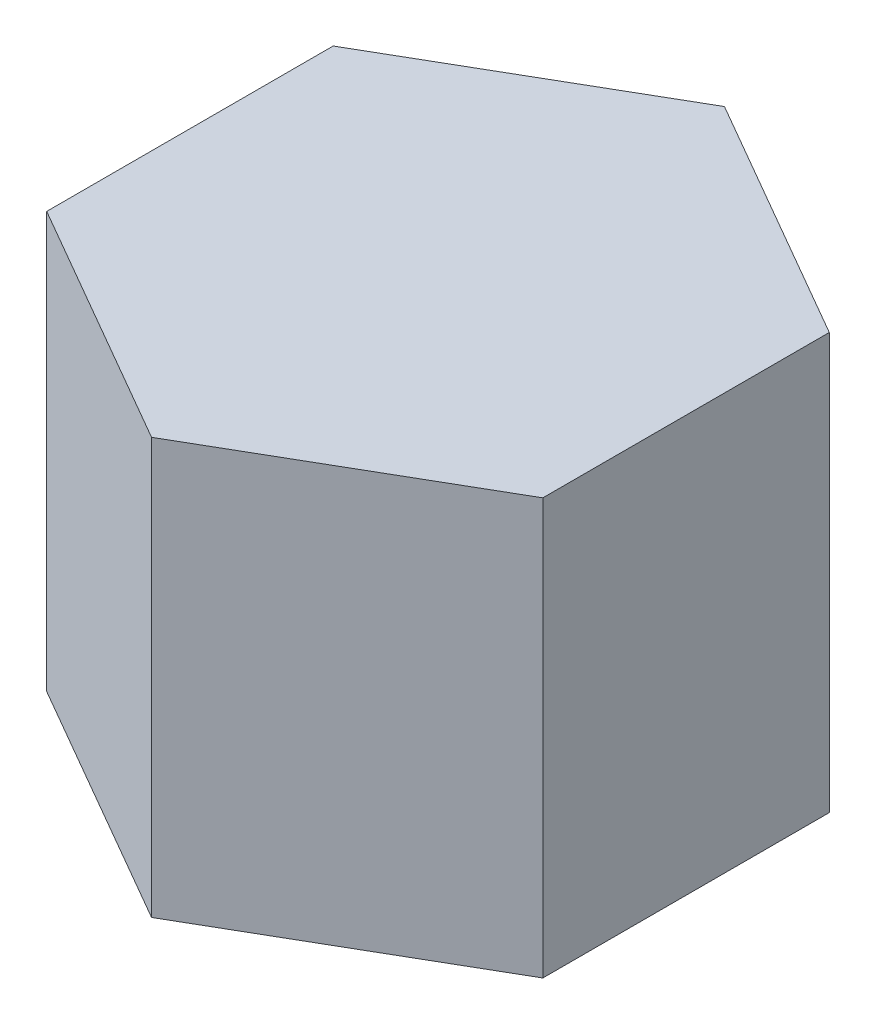
ISO-10303-21;
HEADER;
FILE_DESCRIPTION(('STEP AP214'),'2;1');
FILE_NAME('part.step','',(''),(''),'','','');
FILE_SCHEMA(('AUTOMOTIVE_DESIGN { 1 0 10303 214 1 1 1 1 }'));
ENDSEC;
DATA;
#1=APPLICATION_CONTEXT('core data for automotive mechanical design processes');
#2=APPLICATION_PROTOCOL_DEFINITION('international standard','automotive_design',2000,#1);
#3=PRODUCT_CONTEXT('',#1,'mechanical');
#4=PRODUCT('Part','Part','',(#3));
#5=PRODUCT_RELATED_PRODUCT_CATEGORY('part','',(#4));
#6=PRODUCT_DEFINITION_FORMATION('','',#4);
#7=PRODUCT_DEFINITION_CONTEXT('part definition',#1,'design');
#8=PRODUCT_DEFINITION('design','',#6,#7);
#9=PRODUCT_DEFINITION_SHAPE('','',#8);
#10=(LENGTH_UNIT() NAMED_UNIT(*) SI_UNIT(.MILLI.,.METRE.));
#11=(NAMED_UNIT(*) PLANE_ANGLE_UNIT() SI_UNIT($,.RADIAN.));
#12=(NAMED_UNIT(*) SI_UNIT($,.STERADIAN.) SOLID_ANGLE_UNIT());
#13=UNCERTAINTY_MEASURE_WITH_UNIT(LENGTH_MEASURE(1.E-05),#10,'distance_accuracy_value','');
#14=(GEOMETRIC_REPRESENTATION_CONTEXT(3) GLOBAL_UNCERTAINTY_ASSIGNED_CONTEXT((#13)) GLOBAL_UNIT_ASSIGNED_CONTEXT((#10,
#11,#12)) REPRESENTATION_CONTEXT('',''));
#15=CARTESIAN_POINT('',(0.,0.,0.));
#16=DIRECTION('',(0.,0.,1.));
#17=DIRECTION('',(1.,0.,0.));
#18=AXIS2_PLACEMENT_3D('',#15,#16,#17);
#19=CARTESIAN_POINT('',(209.142660308706,-148.537700895744,292.372996624279));
#20=DIRECTION('',(-0.499999999999909,0.,-0.866025403784491));
#21=DIRECTION('',(-0.866025403784491,0.,0.499999999999909));
#22=AXIS2_PLACEMENT_3D('',#19,#20,#21);
#23=PLANE('',#22);
#24=CARTESIAN_POINT('',(208.839551417382,-149.045793579175,292.547996624279));
#25=DIRECTION('',(0.866025403784491,0.,-0.499999999999909));
#26=VECTOR('',#25,1.);
#27=LINE('',#24,#26);
#28=CARTESIAN_POINT('',(208.839551417382,-149.045793579175,292.547996624279));
#29=VERTEX_POINT('',#28);
#30=CARTESIAN_POINT('',(209.142660308706,-149.045793579175,292.372996624279));
#31=VERTEX_POINT('',#30);
#32=EDGE_CURVE('E170',#29,#31,#27,.T.);
#33=ORIENTED_EDGE('',*,*,#32,.T.);
#34=CARTESIAN_POINT('',(209.142660308706,-148.537700895744,292.372996624279));
#35=DIRECTION('',(0.,-1.,0.));
#36=VECTOR('',#35,1.);
#37=LINE('',#34,#36);
#38=CARTESIAN_POINT('',(209.142660308706,-148.537700895744,292.372996624279));
#39=VERTEX_POINT('',#38);
#40=EDGE_CURVE('E35',#39,#31,#37,.T.);
#41=ORIENTED_EDGE('',*,*,#40,.F.);
#42=CARTESIAN_POINT('',(208.839551417382,-148.537700895744,292.547996624279));
#43=DIRECTION('',(0.866025403784491,0.,-0.499999999999909));
#44=VECTOR('',#43,1.);
#45=LINE('',#42,#44);
#46=CARTESIAN_POINT('',(208.839551417382,-148.537700895744,292.547996624279));
#47=VERTEX_POINT('',#46);
#48=EDGE_CURVE('E159',#47,#39,#45,.T.);
#49=ORIENTED_EDGE('',*,*,#48,.F.);
#50=CARTESIAN_POINT('',(208.839551417382,-148.537700895744,292.547996624279));
#51=DIRECTION('',(0.,-1.,0.));
#52=VECTOR('',#51,1.);
#53=LINE('',#50,#52);
#54=EDGE_CURVE('E10',#47,#29,#53,.T.);
#55=ORIENTED_EDGE('',*,*,#54,.T.);
#56=EDGE_LOOP('',(#33,#41,#49,#55));
#57=FACE_BOUND('',#56,.T.);
#58=ADVANCED_FACE('F16',(#57),#23,.F.);
#59=CARTESIAN_POINT('',(208.839551417382,-148.537700895744,292.547996624279));
#60=DIRECTION('',(0.500000000000096,0.,-0.866025403784383));
#61=DIRECTION('',(-0.866025403784383,0.,-0.500000000000096));
#62=AXIS2_PLACEMENT_3D('',#59,#60,#61);
#63=PLANE('',#62);
#64=CARTESIAN_POINT('',(208.536442526057,-149.045793579175,292.372996624279));
#65=DIRECTION('',(0.866025403784383,0.,0.500000000000096));
#66=VECTOR('',#65,1.);
#67=LINE('',#64,#66);
#68=CARTESIAN_POINT('',(208.536442526057,-149.045793579175,292.372996624279));
#69=VERTEX_POINT('',#68);
#70=EDGE_CURVE('E167',#69,#29,#67,.T.);
#71=ORIENTED_EDGE('',*,*,#70,.T.);
#72=ORIENTED_EDGE('',*,*,#54,.F.);
#73=CARTESIAN_POINT('',(208.536442526057,-148.537700895744,292.372996624279));
#74=DIRECTION('',(0.866025403784383,0.,0.500000000000096));
#75=VECTOR('',#74,1.);
#76=LINE('',#73,#75);
#77=CARTESIAN_POINT('',(208.536442526057,-148.537700895744,292.372996624279));
#78=VERTEX_POINT('',#77);
#79=EDGE_CURVE('E156',#78,#47,#76,.T.);
#80=ORIENTED_EDGE('',*,*,#79,.F.);
#81=CARTESIAN_POINT('',(208.536442526057,-148.537700895744,292.372996624279));
#82=DIRECTION('',(0.,-1.,0.));
#83=VECTOR('',#82,1.);
#84=LINE('',#81,#83);
#85=EDGE_CURVE('E27',#78,#69,#84,.T.);
#86=ORIENTED_EDGE('',*,*,#85,.T.);
#87=EDGE_LOOP('',(#71,#72,#80,#86));
#88=FACE_BOUND('',#87,.T.);
#89=ADVANCED_FACE('F189',(#88),#63,.F.);
#90=CARTESIAN_POINT('',(208.536442526057,-148.537700895744,290.831971220494));
#91=DIRECTION('',(1.,0.,0.));
#92=DIRECTION('',(0.,1.,0.));
#93=AXIS2_PLACEMENT_3D('',#90,#91,#92);
#94=PLANE('',#93);
#95=CARTESIAN_POINT('',(208.536442526057,-149.045793579175,292.022996624279));
#96=DIRECTION('',(0.,0.,1.));
#97=VECTOR('',#96,1.);
#98=LINE('',#95,#97);
#99=CARTESIAN_POINT('',(208.536442526057,-149.045793579175,292.022996624279));
#100=VERTEX_POINT('',#99);
#101=EDGE_CURVE('E163',#100,#69,#98,.T.);
#102=ORIENTED_EDGE('',*,*,#101,.T.);
#103=ORIENTED_EDGE('',*,*,#85,.F.);
#104=CARTESIAN_POINT('',(208.536442526057,-148.537700895744,292.022996624279));
#105=DIRECTION('',(0.,0.,1.));
#106=VECTOR('',#105,1.);
#107=LINE('',#104,#106);
#108=CARTESIAN_POINT('',(208.536442526057,-148.537700895744,292.022996624279));
#109=VERTEX_POINT('',#108);
#110=EDGE_CURVE('E106',#109,#78,#107,.T.);
#111=ORIENTED_EDGE('',*,*,#110,.F.);
#112=CARTESIAN_POINT('',(208.536442526057,-148.537700895744,292.022996624279));
#113=DIRECTION('',(0.,-1.,0.));
#114=VECTOR('',#113,1.);
#115=LINE('',#112,#114);
#116=EDGE_CURVE('E94',#109,#100,#115,.T.);
#117=ORIENTED_EDGE('',*,*,#116,.T.);
#118=EDGE_LOOP('',(#102,#103,#111,#117));
#119=FACE_BOUND('',#118,.T.);
#120=ADVANCED_FACE('F198',(#119),#94,.F.);
#121=CARTESIAN_POINT('',(208.536442526057,-148.537700895744,292.022996624279));
#122=DIRECTION('',(0.499999999999943,0.,0.866025403784472));
#123=DIRECTION('',(0.866025403784472,0.,-0.499999999999943));
#124=AXIS2_PLACEMENT_3D('',#121,#122,#123);
#125=PLANE('',#124);
#126=CARTESIAN_POINT('',(208.839551417382,-149.045793579175,291.847996624279));
#127=DIRECTION('',(-0.866025403784471,0.,0.499999999999943));
#128=VECTOR('',#127,1.);
#129=LINE('',#126,#128);
#130=CARTESIAN_POINT('',(208.839551417382,-149.045793579175,291.847996624279));
#131=VERTEX_POINT('',#130);
#132=EDGE_CURVE('E162',#131,#100,#129,.T.);
#133=ORIENTED_EDGE('',*,*,#132,.T.);
#134=ORIENTED_EDGE('',*,*,#116,.F.);
#135=CARTESIAN_POINT('',(208.839551417382,-148.537700895744,291.847996624279));
#136=DIRECTION('',(-0.866025403784471,0.,0.499999999999943));
#137=VECTOR('',#136,1.);
#138=LINE('',#135,#137);
#139=CARTESIAN_POINT('',(208.839551417382,-148.537700895744,291.847996624279));
#140=VERTEX_POINT('',#139);
#141=EDGE_CURVE('E98',#140,#109,#138,.T.);
#142=ORIENTED_EDGE('',*,*,#141,.F.);
#143=CARTESIAN_POINT('',(208.839551417382,-148.537700895744,291.847996624279));
#144=DIRECTION('',(0.,-1.,0.));
#145=VECTOR('',#144,1.);
#146=LINE('',#143,#145);
#147=EDGE_CURVE('E79',#140,#131,#146,.T.);
#148=ORIENTED_EDGE('',*,*,#147,.T.);
#149=EDGE_LOOP('',(#133,#134,#142,#148));
#150=FACE_BOUND('',#149,.T.);
#151=ADVANCED_FACE('F100',(#150),#125,.F.);
#152=CARTESIAN_POINT('',(208.839551417382,-148.537700895744,291.847996624279));
#153=DIRECTION('',(-0.500000000000062,0.,0.866025403784403));
#154=DIRECTION('',(0.866025403784403,0.,0.500000000000062));
#155=AXIS2_PLACEMENT_3D('',#152,#153,#154);
#156=PLANE('',#155);
#157=CARTESIAN_POINT('',(209.142660308706,-149.045793579175,292.022996624279));
#158=DIRECTION('',(-0.866025403784403,0.,-0.500000000000062));
#159=VECTOR('',#158,1.);
#160=LINE('',#157,#159);
#161=CARTESIAN_POINT('',(209.142660308706,-149.045793579175,292.022996624279));
#162=VERTEX_POINT('',#161);
#163=EDGE_CURVE('E88',#162,#131,#160,.T.);
#164=ORIENTED_EDGE('',*,*,#163,.T.);
#165=ORIENTED_EDGE('',*,*,#147,.F.);
#166=CARTESIAN_POINT('',(209.142660308706,-148.537700895744,292.022996624279));
#167=DIRECTION('',(-0.866025403784403,0.,-0.500000000000062));
#168=VECTOR('',#167,1.);
#169=LINE('',#166,#168);
#170=CARTESIAN_POINT('',(209.142660308706,-148.537700895744,292.022996624279));
#171=VERTEX_POINT('',#170);
#172=EDGE_CURVE('E84',#171,#140,#169,.T.);
#173=ORIENTED_EDGE('',*,*,#172,.F.);
#174=CARTESIAN_POINT('',(209.142660308706,-148.537700895744,292.022996624279));
#175=DIRECTION('',(0.,-1.,0.));
#176=VECTOR('',#175,1.);
#177=LINE('',#174,#176);
#178=EDGE_CURVE('E58',#171,#162,#177,.T.);
#179=ORIENTED_EDGE('',*,*,#178,.T.);
#180=EDGE_LOOP('',(#164,#165,#173,#179));
#181=FACE_BOUND('',#180,.T.);
#182=ADVANCED_FACE('F82',(#181),#156,.F.);
#183=CARTESIAN_POINT('',(209.142660308706,-148.537700895744,290.831971220494));
#184=DIRECTION('',(-1.,0.,0.));
#185=DIRECTION('',(0.,-1.,0.));
#186=AXIS2_PLACEMENT_3D('',#183,#184,#185);
#187=PLANE('',#186);
#188=CARTESIAN_POINT('',(209.142660308706,-149.045793579175,292.372996624279));
#189=DIRECTION('',(0.,0.,-1.));
#190=VECTOR('',#189,1.);
#191=LINE('',#188,#190);
#192=EDGE_CURVE('E160',#31,#162,#191,.T.);
#193=ORIENTED_EDGE('',*,*,#192,.T.);
#194=ORIENTED_EDGE('',*,*,#178,.F.);
#195=CARTESIAN_POINT('',(209.142660308706,-148.537700895744,292.372996624279));
#196=DIRECTION('',(0.,0.,-1.));
#197=VECTOR('',#196,1.);
#198=LINE('',#195,#197);
#199=EDGE_CURVE('E112',#39,#171,#198,.T.);
#200=ORIENTED_EDGE('',*,*,#199,.F.);
#201=ORIENTED_EDGE('',*,*,#40,.T.);
#202=EDGE_LOOP('',(#193,#194,#200,#201));
#203=FACE_BOUND('',#202,.T.);
#204=ADVANCED_FACE('F131',(#203),#187,.F.);
#205=CARTESIAN_POINT('',(206.339551417382,-148.537700895744,290.831971220494));
#206=DIRECTION('',(0.,-1.,0.));
#207=DIRECTION('',(1.,0.,0.));
#208=AXIS2_PLACEMENT_3D('',#205,#206,#207);
#209=PLANE('',#208);
#210=ORIENTED_EDGE('',*,*,#48,.T.);
#211=ORIENTED_EDGE('',*,*,#199,.T.);
#212=ORIENTED_EDGE('',*,*,#172,.T.);
#213=ORIENTED_EDGE('',*,*,#141,.T.);
#214=ORIENTED_EDGE('',*,*,#110,.T.);
#215=ORIENTED_EDGE('',*,*,#79,.T.);
#216=EDGE_LOOP('',(#210,#211,#212,#213,#214,#215));
#217=FACE_BOUND('',#216,.T.);
#218=ADVANCED_FACE('F111',(#217),#209,.F.);
#219=CARTESIAN_POINT('',(206.339551417382,-149.045793579175,290.831971220494));
#220=DIRECTION('',(0.,-1.,0.));
#221=DIRECTION('',(1.,0.,0.));
#222=AXIS2_PLACEMENT_3D('',#219,#220,#221);
#223=PLANE('',#222);
#224=ORIENTED_EDGE('',*,*,#32,.F.);
#225=ORIENTED_EDGE('',*,*,#70,.F.);
#226=ORIENTED_EDGE('',*,*,#101,.F.);
#227=ORIENTED_EDGE('',*,*,#132,.F.);
#228=ORIENTED_EDGE('',*,*,#163,.F.);
#229=ORIENTED_EDGE('',*,*,#192,.F.);
#230=EDGE_LOOP('',(#224,#225,#226,#227,#228,#229));
#231=FACE_BOUND('',#230,.T.);
#232=ADVANCED_FACE('F130',(#231),#223,.T.);
#233=CLOSED_SHELL('',(#58,#89,#120,#151,#182,#204,#218,#232));
#234=MANIFOLD_SOLID_BREP('B1',#233);
#235=ADVANCED_BREP_SHAPE_REPRESENTATION('',(#18,#234),#14);
#236=SHAPE_DEFINITION_REPRESENTATION(#9,#235);
ENDSEC;
END-ISO-10303-21;
